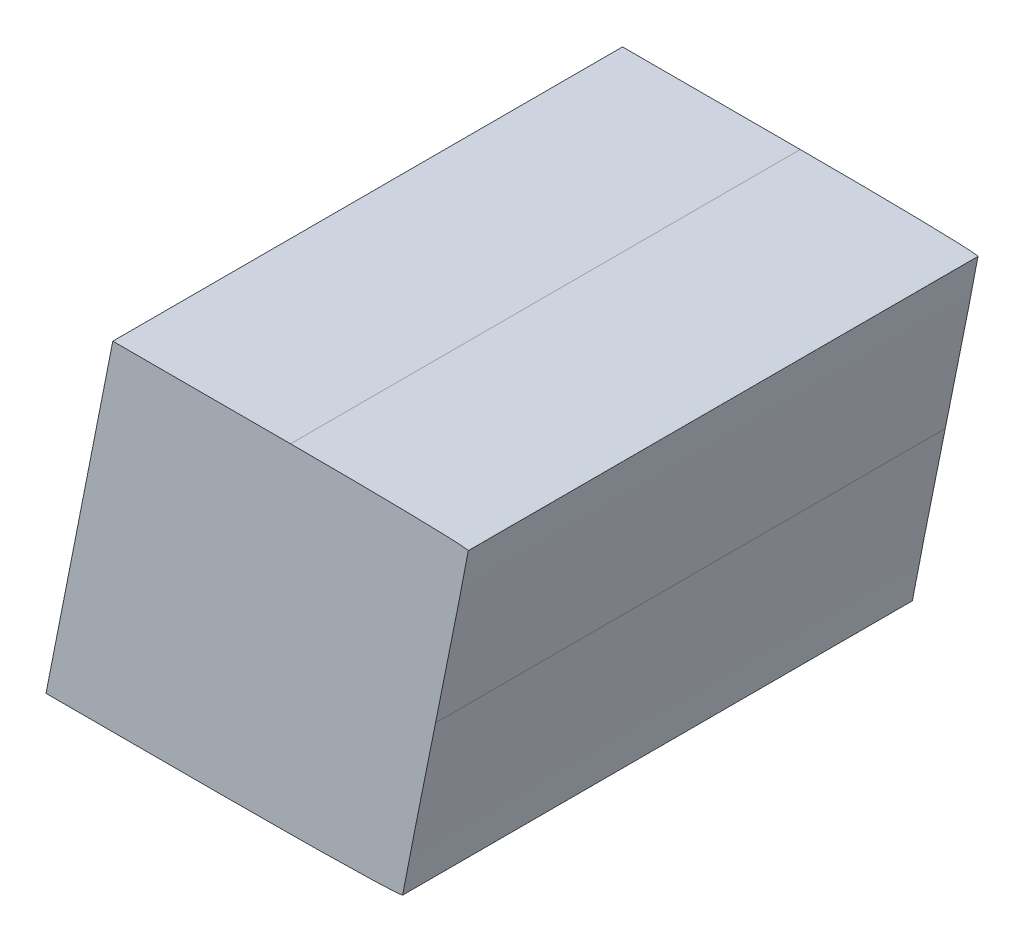
ISO-10303-21;
HEADER;
FILE_DESCRIPTION(('STEP AP214'),'2;1');
FILE_NAME('part.step','',(''),(''),'','','');
FILE_SCHEMA(('AUTOMOTIVE_DESIGN { 1 0 10303 214 1 1 1 1 }'));
ENDSEC;
DATA;
#1=APPLICATION_CONTEXT('core data for automotive mechanical design processes');
#2=APPLICATION_PROTOCOL_DEFINITION('international standard','automotive_design',2000,#1);
#3=PRODUCT_CONTEXT('',#1,'mechanical');
#4=PRODUCT('Part','Part','',(#3));
#5=PRODUCT_RELATED_PRODUCT_CATEGORY('part','',(#4));
#6=PRODUCT_DEFINITION_FORMATION('','',#4);
#7=PRODUCT_DEFINITION_CONTEXT('part definition',#1,'design');
#8=PRODUCT_DEFINITION('design','',#6,#7);
#9=PRODUCT_DEFINITION_SHAPE('','',#8);
#10=(LENGTH_UNIT() NAMED_UNIT(*) SI_UNIT(.MILLI.,.METRE.));
#11=(NAMED_UNIT(*) PLANE_ANGLE_UNIT() SI_UNIT($,.RADIAN.));
#12=(NAMED_UNIT(*) SI_UNIT($,.STERADIAN.) SOLID_ANGLE_UNIT());
#13=UNCERTAINTY_MEASURE_WITH_UNIT(LENGTH_MEASURE(1.E-05),#10,'distance_accuracy_value','');
#14=(GEOMETRIC_REPRESENTATION_CONTEXT(3) GLOBAL_UNCERTAINTY_ASSIGNED_CONTEXT((#13)) GLOBAL_UNIT_ASSIGNED_CONTEXT((#10,
#11,#12)) REPRESENTATION_CONTEXT('',''));
#15=CARTESIAN_POINT('',(0.,0.,0.));
#16=DIRECTION('',(0.,0.,1.));
#17=DIRECTION('',(1.,0.,0.));
#18=AXIS2_PLACEMENT_3D('',#15,#16,#17);
#19=CARTESIAN_POINT('',(1.7133331718623,0.344055376631822,0.));
#20=DIRECTION('',(-0.981080767533104,0.193598883200952,0.));
#21=DIRECTION('',(-0.193598883200952,-0.981080767533104,0.));
#22=AXIS2_PLACEMENT_3D('',#19,#20,#21);
#23=PLANE('',#22);
#24=DIRECTION('',(-0.193598883200952,-0.981080767533104,0.));
#25=VECTOR('',#24,1.);
#26=CARTESIAN_POINT('',(1.7133331718623,0.344055376631822,0.));
#27=LINE('',#26,#25);
#28=CARTESIAN_POINT('',(1.7133331718623,0.344055376631822,0.));
#29=VERTEX_POINT('',#28);
#30=CARTESIAN_POINT('',(1.7067827639637,0.310860561131822,0.));
#31=VERTEX_POINT('',#30);
#32=EDGE_CURVE('E11',#29,#31,#27,.T.);
#33=ORIENTED_EDGE('',*,*,#32,.T.);
#34=DIRECTION('',(0.,0.,1.));
#35=VECTOR('',#34,1.);
#36=CARTESIAN_POINT('',(1.7067827639637,0.310860561131822,0.));
#37=LINE('',#36,#35);
#38=CARTESIAN_POINT('',(1.7067827639637,0.310860561131822,0.1));
#39=VERTEX_POINT('',#38);
#40=EDGE_CURVE('E24',#31,#39,#37,.T.);
#41=ORIENTED_EDGE('',*,*,#40,.T.);
#42=DIRECTION('',(-0.193598883200952,-0.981080767533104,0.));
#43=VECTOR('',#42,1.);
#44=CARTESIAN_POINT('',(1.7133331718623,0.344055376631822,0.1));
#45=LINE('',#44,#43);
#46=CARTESIAN_POINT('',(1.7133331718623,0.344055376631822,0.1));
#47=VERTEX_POINT('',#46);
#48=EDGE_CURVE('E100',#47,#39,#45,.T.);
#49=ORIENTED_EDGE('',*,*,#48,.F.);
#50=DIRECTION('',(0.,0.,1.));
#51=VECTOR('',#50,1.);
#52=CARTESIAN_POINT('',(1.7133331718623,0.344055376631822,0.));
#53=LINE('',#52,#51);
#54=EDGE_CURVE('E186',#29,#47,#53,.T.);
#55=ORIENTED_EDGE('',*,*,#54,.F.);
#56=EDGE_LOOP('',(#33,#41,#49,#55));
#57=FACE_BOUND('',#56,.T.);
#58=ADVANCED_FACE('F17',(#57),#23,.T.);
#59=CARTESIAN_POINT('',(1.748201926952,0.344055376631822,0.));
#60=DIRECTION('',(0.,1.,0.));
#61=DIRECTION('',(-1.,0.,0.));
#62=AXIS2_PLACEMENT_3D('',#59,#60,#61);
#63=PLANE('',#62);
#64=DIRECTION('',(-1.,0.,0.));
#65=VECTOR('',#64,1.);
#66=CARTESIAN_POINT('',(1.7482019269519,0.344055376631822,0.));
#67=LINE('',#66,#65);
#68=CARTESIAN_POINT('',(1.7482019269519,0.344055376631822,0.));
#69=VERTEX_POINT('',#68);
#70=EDGE_CURVE('E183',#69,#29,#67,.T.);
#71=ORIENTED_EDGE('',*,*,#70,.T.);
#72=ORIENTED_EDGE('',*,*,#54,.T.);
#73=DIRECTION('',(-1.,0.,0.));
#74=VECTOR('',#73,1.);
#75=CARTESIAN_POINT('',(1.7482019269519,0.344055376631822,0.1));
#76=LINE('',#75,#74);
#77=CARTESIAN_POINT('',(1.7482019269519,0.344055376631822,0.1));
#78=VERTEX_POINT('',#77);
#79=EDGE_CURVE('E181',#78,#47,#76,.T.);
#80=ORIENTED_EDGE('',*,*,#79,.F.);
#81=DIRECTION('',(0.,0.,1.));
#82=VECTOR('',#81,1.);
#83=CARTESIAN_POINT('',(1.7482019269519,0.344055376631822,0.));
#84=LINE('',#83,#82);
#85=EDGE_CURVE('E175',#69,#78,#84,.T.);
#86=ORIENTED_EDGE('',*,*,#85,.F.);
#87=EDGE_LOOP('',(#71,#72,#80,#86));
#88=FACE_BOUND('',#87,.T.);
#89=ADVANCED_FACE('F203',(#88),#63,.T.);
#90=CARTESIAN_POINT('',(1.7830706606256,0.343318708719842,0.));
#91=CARTESIAN_POINT('',(1.7830706606256,0.343318708719842,0.1));
#92=CARTESIAN_POINT('',(1.783070660626,0.343723878212903,0.));
#93=CARTESIAN_POINT('',(1.783070660626,0.343723878212903,0.1));
#94=CARTESIAN_POINT('',(1.767379728331,0.344055376631896,0.));
#95=CARTESIAN_POINT('',(1.767379728331,0.344055376631896,0.1));
#96=CARTESIAN_POINT('',(1.7482019269519,0.344055376631822,0.));
#97=CARTESIAN_POINT('',(1.7482019269519,0.344055376631822,0.1));
#98=B_SPLINE_SURFACE_WITH_KNOTS('',3,1,((#90,#91),(#92,#93),(#94,#95),(#96,#97)),.UNSPECIFIED.,
.F.,.F.,.F.,(4,4),(2,2),(0.,1.),(0.,0.01),.UNSPECIFIED.);
#99=CARTESIAN_POINT('',(1.7830706606256,0.343318708719842,0.));
#100=CARTESIAN_POINT('',(1.783070660626,0.343723878212903,0.));
#101=CARTESIAN_POINT('',(1.767379728331,0.344055376631896,0.));
#102=CARTESIAN_POINT('',(1.7482019269519,0.344055376631822,0.));
#103=B_SPLINE_CURVE_WITH_KNOTS('',3,(#99,#100,#101,#102),.UNSPECIFIED.,.F.,.F.,(4,4),(0.,1.),.UNSPECIFIED.);
#104=CARTESIAN_POINT('',(1.7830706606256,0.343318708719842,0.));
#105=VERTEX_POINT('',#104);
#106=EDGE_CURVE('E167',#105,#69,#103,.T.);
#107=CARTESIAN_POINT('',(1.7830706606256,0.343318708719842,0.1));
#108=CARTESIAN_POINT('',(1.783070660626,0.343723878212903,0.1));
#109=CARTESIAN_POINT('',(1.767379728331,0.344055376631896,0.1));
#110=CARTESIAN_POINT('',(1.7482019269519,0.344055376631822,0.1));
#111=B_SPLINE_CURVE_WITH_KNOTS('',3,(#107,#108,#109,#110),.UNSPECIFIED.,.F.,.F.,(4,4),(0.,1.),.UNSPECIFIED.);
#112=CARTESIAN_POINT('',(1.7830706606256,0.343318708719842,0.1));
#113=VERTEX_POINT('',#112);
#114=EDGE_CURVE('E162',#113,#78,#111,.T.);
#115=DIRECTION('',(0.,0.,1.));
#116=VECTOR('',#115,1.);
#117=CARTESIAN_POINT('',(1.7830706606256,0.343318708719842,0.));
#118=LINE('',#117,#116);
#119=EDGE_CURVE('E156',#105,#113,#118,.T.);
#120=ORIENTED_EDGE('',*,*,#106,.T.);
#121=ORIENTED_EDGE('',*,*,#85,.T.);
#122=ORIENTED_EDGE('',*,*,#114,.F.);
#123=ORIENTED_EDGE('',*,*,#119,.F.);
#124=EDGE_LOOP('',(#120,#121,#122,#123));
#125=FACE_BOUND('',#124,.T.);
#126=ADVANCED_FACE('F200',(#125),#98,.T.);
#127=CARTESIAN_POINT('',(1.7766458576256,0.310860561131822,0.));
#128=CARTESIAN_POINT('',(1.7766458576256,0.310860561131822,0.1));
#129=CARTESIAN_POINT('',(1.7801794989588,0.328307370731467,0.));
#130=CARTESIAN_POINT('',(1.7801794989588,0.328307370731467,0.1));
#131=CARTESIAN_POINT('',(1.7830706606172,0.342913539226574,0.));
#132=CARTESIAN_POINT('',(1.7830706606172,0.342913539226574,0.1));
#133=CARTESIAN_POINT('',(1.7830706606256,0.343318708719842,0.));
#134=CARTESIAN_POINT('',(1.7830706606256,0.343318708719842,0.1));
#135=B_SPLINE_SURFACE_WITH_KNOTS('',3,1,((#127,#128),(#129,#130),(#131,#132),(#133,#134)),
.UNSPECIFIED.,.F.,.F.,.F.,(4,4),(2,2),(0.,1.),(0.,0.01),.UNSPECIFIED.);
#136=CARTESIAN_POINT('',(1.7766458576256,0.310860561131822,0.));
#137=CARTESIAN_POINT('',(1.7801794989588,0.328307370731467,0.));
#138=CARTESIAN_POINT('',(1.7830706606172,0.342913539226574,0.));
#139=CARTESIAN_POINT('',(1.7830706606256,0.343318708719842,0.));
#140=B_SPLINE_CURVE_WITH_KNOTS('',3,(#136,#137,#138,#139),.UNSPECIFIED.,.F.,.F.,(4,4),(0.,1.),.UNSPECIFIED.);
#141=CARTESIAN_POINT('',(1.7766458576256,0.310860561131822,0.));
#142=VERTEX_POINT('',#141);
#143=EDGE_CURVE('E148',#142,#105,#140,.T.);
#144=CARTESIAN_POINT('',(1.7766458576256,0.310860561131822,0.1));
#145=CARTESIAN_POINT('',(1.7801794989588,0.328307370731467,0.1));
#146=CARTESIAN_POINT('',(1.7830706606172,0.342913539226574,0.1));
#147=CARTESIAN_POINT('',(1.7830706606256,0.343318708719842,0.1));
#148=B_SPLINE_CURVE_WITH_KNOTS('',3,(#144,#145,#146,#147),.UNSPECIFIED.,.F.,.F.,(4,4),(0.,1.),.UNSPECIFIED.);
#149=CARTESIAN_POINT('',(1.7766458576256,0.310860561131822,0.1));
#150=VERTEX_POINT('',#149);
#151=EDGE_CURVE('E143',#150,#113,#148,.T.);
#152=DIRECTION('',(0.,0.,1.));
#153=VECTOR('',#152,1.);
#154=CARTESIAN_POINT('',(1.7766458576256,0.310860561131822,0.));
#155=LINE('',#154,#153);
#156=EDGE_CURVE('E137',#142,#150,#155,.T.);
#157=ORIENTED_EDGE('',*,*,#143,.T.);
#158=ORIENTED_EDGE('',*,*,#119,.T.);
#159=ORIENTED_EDGE('',*,*,#151,.F.);
#160=ORIENTED_EDGE('',*,*,#156,.F.);
#161=EDGE_LOOP('',(#157,#158,#159,#160));
#162=FACE_BOUND('',#161,.T.);
#163=ADVANCED_FACE('F197',(#162),#135,.T.);
#164=CARTESIAN_POINT('',(1.7702210546256,0.278402413543802,0.));
#165=CARTESIAN_POINT('',(1.7702210546256,0.278402413543802,0.1));
#166=CARTESIAN_POINT('',(1.7702210543458,0.278807583093137,0.));
#167=CARTESIAN_POINT('',(1.7702210543458,0.278807583093137,0.1));
#168=CARTESIAN_POINT('',(1.7731122158231,0.293413751624089,0.));
#169=CARTESIAN_POINT('',(1.7731122158231,0.293413751624089,0.1));
#170=CARTESIAN_POINT('',(1.7766458576256,0.310860561131822,0.));
#171=CARTESIAN_POINT('',(1.7766458576256,0.310860561131822,0.1));
#172=B_SPLINE_SURFACE_WITH_KNOTS('',3,1,((#164,#165),(#166,#167),(#168,#169),(#170,#171)),
.UNSPECIFIED.,.F.,.F.,.F.,(4,4),(2,2),(0.,1.),(0.,0.01),.UNSPECIFIED.);
#173=CARTESIAN_POINT('',(1.7702210546256,0.278402413543802,0.));
#174=CARTESIAN_POINT('',(1.7702210543458,0.278807583093137,0.));
#175=CARTESIAN_POINT('',(1.7731122158231,0.293413751624089,0.));
#176=CARTESIAN_POINT('',(1.7766458576256,0.310860561131822,0.));
#177=B_SPLINE_CURVE_WITH_KNOTS('',3,(#173,#174,#175,#176),.UNSPECIFIED.,.F.,.F.,(4,4),(0.,1.),.UNSPECIFIED.);
#178=CARTESIAN_POINT('',(1.7702210546256,0.278402413543802,0.));
#179=VERTEX_POINT('',#178);
#180=EDGE_CURVE('E129',#179,#142,#177,.T.);
#181=CARTESIAN_POINT('',(1.7702210546256,0.278402413543802,0.1));
#182=CARTESIAN_POINT('',(1.7702210543458,0.278807583093137,0.1));
#183=CARTESIAN_POINT('',(1.7731122158231,0.293413751624089,0.1));
#184=CARTESIAN_POINT('',(1.7766458576256,0.310860561131822,0.1));
#185=B_SPLINE_CURVE_WITH_KNOTS('',3,(#181,#182,#183,#184),.UNSPECIFIED.,.F.,.F.,(4,4),(0.,1.),.UNSPECIFIED.);
#186=CARTESIAN_POINT('',(1.7702210546256,0.278402413543802,0.1));
#187=VERTEX_POINT('',#186);
#188=EDGE_CURVE('E124',#187,#150,#185,.T.);
#189=DIRECTION('',(0.,0.,1.));
#190=VECTOR('',#189,1.);
#191=CARTESIAN_POINT('',(1.7702210546256,0.278402413543802,0.));
#192=LINE('',#191,#190);
#193=EDGE_CURVE('E118',#179,#187,#192,.T.);
#194=ORIENTED_EDGE('',*,*,#180,.T.);
#195=ORIENTED_EDGE('',*,*,#156,.T.);
#196=ORIENTED_EDGE('',*,*,#188,.F.);
#197=ORIENTED_EDGE('',*,*,#193,.F.);
#198=EDGE_LOOP('',(#194,#195,#196,#197));
#199=FACE_BOUND('',#198,.T.);
#200=ADVANCED_FACE('F194',(#199),#172,.T.);
#201=CARTESIAN_POINT('',(1.7352267160533,0.277665745631822,0.));
#202=CARTESIAN_POINT('',(1.7352267160533,0.277665745631822,0.1));
#203=CARTESIAN_POINT('',(1.7544736054959,0.277665745300054,0.));
#204=CARTESIAN_POINT('',(1.7544736054959,0.277665745300054,0.1));
#205=CARTESIAN_POINT('',(1.7702210546344,0.277997244050654,0.));
#206=CARTESIAN_POINT('',(1.7702210546344,0.277997244050654,0.1));
#207=CARTESIAN_POINT('',(1.7702210546256,0.278402413543802,0.));
#208=CARTESIAN_POINT('',(1.7702210546256,0.278402413543802,0.1));
#209=B_SPLINE_SURFACE_WITH_KNOTS('',3,1,((#201,#202),(#203,#204),(#205,#206),(#207,#208)),
.UNSPECIFIED.,.F.,.F.,.F.,(4,4),(2,2),(0.,1.),(0.,0.01),.UNSPECIFIED.);
#210=CARTESIAN_POINT('',(1.7352267160533,0.277665745631822,0.));
#211=CARTESIAN_POINT('',(1.7544736054959,0.277665745300054,0.));
#212=CARTESIAN_POINT('',(1.7702210546344,0.277997244050654,0.));
#213=CARTESIAN_POINT('',(1.7702210546256,0.278402413543802,0.));
#214=B_SPLINE_CURVE_WITH_KNOTS('',3,(#210,#211,#212,#213),.UNSPECIFIED.,.F.,.F.,(4,4),(0.,1.),.UNSPECIFIED.);
#215=CARTESIAN_POINT('',(1.7352267160533,0.277665745631822,0.));
#216=VERTEX_POINT('',#215);
#217=EDGE_CURVE('E110',#216,#179,#214,.T.);
#218=CARTESIAN_POINT('',(1.7352267160533,0.277665745631822,0.1));
#219=CARTESIAN_POINT('',(1.7544736054959,0.277665745300054,0.1));
#220=CARTESIAN_POINT('',(1.7702210546344,0.277997244050654,0.1));
#221=CARTESIAN_POINT('',(1.7702210546256,0.278402413543802,0.1));
#222=B_SPLINE_CURVE_WITH_KNOTS('',3,(#218,#219,#220,#221),.UNSPECIFIED.,.F.,.F.,(4,4),(0.,1.),.UNSPECIFIED.);
#223=CARTESIAN_POINT('',(1.7352267160533,0.277665745631822,0.1));
#224=VERTEX_POINT('',#223);
#225=EDGE_CURVE('E106',#224,#187,#222,.T.);
#226=DIRECTION('',(0.,0.,1.));
#227=VECTOR('',#226,1.);
#228=CARTESIAN_POINT('',(1.7352267160533,0.277665745631822,0.));
#229=LINE('',#228,#227);
#230=EDGE_CURVE('E85',#216,#224,#229,.T.);
#231=ORIENTED_EDGE('',*,*,#217,.T.);
#232=ORIENTED_EDGE('',*,*,#193,.T.);
#233=ORIENTED_EDGE('',*,*,#225,.F.);
#234=ORIENTED_EDGE('',*,*,#230,.F.);
#235=EDGE_LOOP('',(#231,#232,#233,#234));
#236=FACE_BOUND('',#235,.T.);
#237=ADVANCED_FACE('F192',(#236),#209,.T.);
#238=CARTESIAN_POINT('',(1.700232377481,0.277665745631822,0.));
#239=DIRECTION('',(0.,-1.,0.));
#240=DIRECTION('',(1.,0.,0.));
#241=AXIS2_PLACEMENT_3D('',#238,#239,#240);
#242=PLANE('',#241);
#243=DIRECTION('',(1.,0.,0.));
#244=VECTOR('',#243,1.);
#245=CARTESIAN_POINT('',(1.700232377481,0.277665745631822,0.));
#246=LINE('',#245,#244);
#247=CARTESIAN_POINT('',(1.700232377481,0.277665745631822,0.));
#248=VERTEX_POINT('',#247);
#249=EDGE_CURVE('E89',#248,#216,#246,.T.);
#250=ORIENTED_EDGE('',*,*,#249,.T.);
#251=ORIENTED_EDGE('',*,*,#230,.T.);
#252=DIRECTION('',(1.,0.,0.));
#253=VECTOR('',#252,1.);
#254=CARTESIAN_POINT('',(1.700232377481,0.277665745631822,0.1));
#255=LINE('',#254,#253);
#256=CARTESIAN_POINT('',(1.700232377481,0.277665745631822,0.1));
#257=VERTEX_POINT('',#256);
#258=EDGE_CURVE('E78',#257,#224,#255,.T.);
#259=ORIENTED_EDGE('',*,*,#258,.F.);
#260=DIRECTION('',(0.,0.,1.));
#261=VECTOR('',#260,1.);
#262=CARTESIAN_POINT('',(1.700232377481,0.277665745631822,0.));
#263=LINE('',#262,#261);
#264=EDGE_CURVE('E82',#248,#257,#263,.T.);
#265=ORIENTED_EDGE('',*,*,#264,.F.);
#266=EDGE_LOOP('',(#250,#251,#259,#265));
#267=FACE_BOUND('',#266,.T.);
#268=ADVANCED_FACE('F81',(#267),#242,.T.);
#269=CARTESIAN_POINT('',(1.7067827639637,0.310860561131822,0.));
#270=DIRECTION('',(-0.981080887754019,0.193598273969027,0.));
#271=DIRECTION('',(-0.193598273969027,-0.981080887754019,0.));
#272=AXIS2_PLACEMENT_3D('',#269,#270,#271);
#273=PLANE('',#272);
#274=DIRECTION('',(-0.193598273969027,-0.981080887754019,0.));
#275=VECTOR('',#274,1.);
#276=CARTESIAN_POINT('',(1.7067827639637,0.310860561131822,0.));
#277=LINE('',#276,#275);
#278=EDGE_CURVE('E95',#31,#248,#277,.T.);
#279=ORIENTED_EDGE('',*,*,#278,.T.);
#280=ORIENTED_EDGE('',*,*,#264,.T.);
#281=DIRECTION('',(-0.193598273969027,-0.981080887754019,0.));
#282=VECTOR('',#281,1.);
#283=CARTESIAN_POINT('',(1.7067827639637,0.310860561131822,0.1));
#284=LINE('',#283,#282);
#285=EDGE_CURVE('E94',#39,#257,#284,.T.);
#286=ORIENTED_EDGE('',*,*,#285,.F.);
#287=ORIENTED_EDGE('',*,*,#40,.F.);
#288=EDGE_LOOP('',(#279,#280,#286,#287));
#289=FACE_BOUND('',#288,.T.);
#290=ADVANCED_FACE('F93',(#289),#273,.T.);
#291=CARTESIAN_POINT('',(1.7378136238529,0.310830186931571,0.1));
#292=DIRECTION('',(0.,0.,1.));
#293=DIRECTION('',(1.,0.,0.));
#294=AXIS2_PLACEMENT_3D('',#291,#292,#293);
#295=PLANE('',#294);
#296=ORIENTED_EDGE('',*,*,#285,.T.);
#297=ORIENTED_EDGE('',*,*,#258,.T.);
#298=ORIENTED_EDGE('',*,*,#225,.T.);
#299=ORIENTED_EDGE('',*,*,#188,.T.);
#300=ORIENTED_EDGE('',*,*,#151,.T.);
#301=ORIENTED_EDGE('',*,*,#114,.T.);
#302=ORIENTED_EDGE('',*,*,#79,.T.);
#303=ORIENTED_EDGE('',*,*,#48,.T.);
#304=EDGE_LOOP('',(#296,#297,#298,#299,#300,#301,#302,#303));
#305=FACE_BOUND('',#304,.T.);
#306=ADVANCED_FACE('F98',(#305),#295,.T.);
#307=CARTESIAN_POINT('',(1.7378136238529,0.310830186931571,0.));
#308=DIRECTION('',(0.,0.,1.));
#309=DIRECTION('',(1.,0.,0.));
#310=AXIS2_PLACEMENT_3D('',#307,#308,#309);
#311=PLANE('',#310);
#312=ORIENTED_EDGE('',*,*,#278,.F.);
#313=ORIENTED_EDGE('',*,*,#32,.F.);
#314=ORIENTED_EDGE('',*,*,#70,.F.);
#315=ORIENTED_EDGE('',*,*,#106,.F.);
#316=ORIENTED_EDGE('',*,*,#143,.F.);
#317=ORIENTED_EDGE('',*,*,#180,.F.);
#318=ORIENTED_EDGE('',*,*,#217,.F.);
#319=ORIENTED_EDGE('',*,*,#249,.F.);
#320=EDGE_LOOP('',(#312,#313,#314,#315,#316,#317,#318,#319));
#321=FACE_BOUND('',#320,.T.);
#322=ADVANCED_FACE('F189',(#321),#311,.F.);
#323=CLOSED_SHELL('',(#58,#89,#126,#163,#200,#237,#268,#290,#306,#322));
#324=MANIFOLD_SOLID_BREP('B1',#323);
#325=ADVANCED_BREP_SHAPE_REPRESENTATION('',(#18,#324),#14);
#326=SHAPE_DEFINITION_REPRESENTATION(#9,#325);
ENDSEC;
END-ISO-10303-21;
